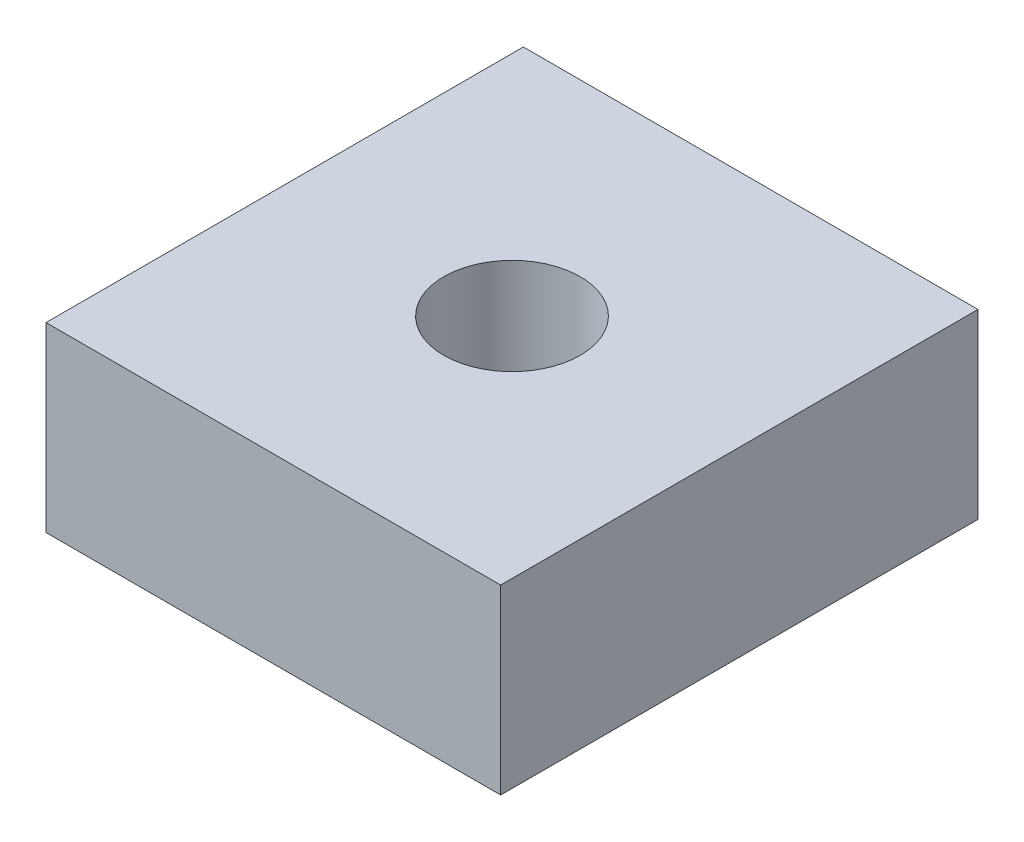
ISO-10303-21;
HEADER;
FILE_DESCRIPTION(('STEP AP214'),'2;1');
FILE_NAME('part.step','',(''),(''),'','','');
FILE_SCHEMA(('AUTOMOTIVE_DESIGN { 1 0 10303 214 1 1 1 1 }'));
ENDSEC;
DATA;
#1=APPLICATION_CONTEXT('core data for automotive mechanical design processes');
#2=APPLICATION_PROTOCOL_DEFINITION('international standard','automotive_design',2000,#1);
#3=PRODUCT_CONTEXT('',#1,'mechanical');
#4=PRODUCT('Part','Part','',(#3));
#5=PRODUCT_RELATED_PRODUCT_CATEGORY('part','',(#4));
#6=PRODUCT_DEFINITION_FORMATION('','',#4);
#7=PRODUCT_DEFINITION_CONTEXT('part definition',#1,'design');
#8=PRODUCT_DEFINITION('design','',#6,#7);
#9=PRODUCT_DEFINITION_SHAPE('','',#8);
#10=(LENGTH_UNIT() NAMED_UNIT(*) SI_UNIT(.MILLI.,.METRE.));
#11=(NAMED_UNIT(*) PLANE_ANGLE_UNIT() SI_UNIT($,.RADIAN.));
#12=(NAMED_UNIT(*) SI_UNIT($,.STERADIAN.) SOLID_ANGLE_UNIT());
#13=UNCERTAINTY_MEASURE_WITH_UNIT(LENGTH_MEASURE(1.E-05),#10,'distance_accuracy_value','');
#14=(GEOMETRIC_REPRESENTATION_CONTEXT(3) GLOBAL_UNCERTAINTY_ASSIGNED_CONTEXT((#13)) GLOBAL_UNIT_ASSIGNED_CONTEXT((#10,
#11,#12)) REPRESENTATION_CONTEXT('',''));
#15=CARTESIAN_POINT('',(0.,0.,0.));
#16=DIRECTION('',(0.,0.,1.));
#17=DIRECTION('',(1.,0.,0.));
#18=AXIS2_PLACEMENT_3D('',#15,#16,#17);
#19=CARTESIAN_POINT('',(0.,4.,0.));
#20=DIRECTION('',(1.,0.,0.));
#21=DIRECTION('',(0.,0.,-1.));
#22=AXIS2_PLACEMENT_3D('',#19,#20,#21);
#23=PLANE('',#22);
#24=DIRECTION('',(0.,0.,1.));
#25=VECTOR('',#24,1.);
#26=CARTESIAN_POINT('',(0.,0.,0.));
#27=LINE('',#26,#25);
#28=CARTESIAN_POINT('',(0.,0.,-10.5));
#29=VERTEX_POINT('',#28);
#30=CARTESIAN_POINT('',(0.,0.,0.));
#31=VERTEX_POINT('',#30);
#32=EDGE_CURVE('E107',#29,#31,#27,.T.);
#33=ORIENTED_EDGE('',*,*,#32,.T.);
#34=DIRECTION('',(0.,-1.,0.));
#35=VECTOR('',#34,1.);
#36=CARTESIAN_POINT('',(0.,4.,0.));
#37=LINE('',#36,#35);
#38=CARTESIAN_POINT('',(0.,4.,0.));
#39=VERTEX_POINT('',#38);
#40=EDGE_CURVE('E11',#39,#31,#37,.T.);
#41=ORIENTED_EDGE('',*,*,#40,.F.);
#42=DIRECTION('',(0.,0.,1.));
#43=VECTOR('',#42,1.);
#44=CARTESIAN_POINT('',(0.,4.,0.));
#45=LINE('',#44,#43);
#46=CARTESIAN_POINT('',(0.,4.,-10.5));
#47=VERTEX_POINT('',#46);
#48=EDGE_CURVE('E91',#47,#39,#45,.T.);
#49=ORIENTED_EDGE('',*,*,#48,.F.);
#50=DIRECTION('',(0.,-1.,0.));
#51=VECTOR('',#50,1.);
#52=CARTESIAN_POINT('',(0.,4.,-10.5));
#53=LINE('',#52,#51);
#54=EDGE_CURVE('E103',#47,#29,#53,.T.);
#55=ORIENTED_EDGE('',*,*,#54,.T.);
#56=EDGE_LOOP('',(#33,#41,#49,#55));
#57=FACE_BOUND('',#56,.T.);
#58=ADVANCED_FACE('F39',(#57),#23,.F.);
#59=CARTESIAN_POINT('',(0.,4.,0.));
#60=DIRECTION('',(0.,0.,-1.));
#61=DIRECTION('',(-1.,0.,0.));
#62=AXIS2_PLACEMENT_3D('',#59,#60,#61);
#63=PLANE('',#62);
#64=DIRECTION('',(1.,0.,0.));
#65=VECTOR('',#64,1.);
#66=CARTESIAN_POINT('',(0.,0.,0.));
#67=LINE('',#66,#65);
#68=CARTESIAN_POINT('',(10.,0.,0.));
#69=VERTEX_POINT('',#68);
#70=EDGE_CURVE('E96',#31,#69,#67,.T.);
#71=ORIENTED_EDGE('',*,*,#70,.T.);
#72=DIRECTION('',(0.,-1.,0.));
#73=VECTOR('',#72,1.);
#74=CARTESIAN_POINT('',(10.,4.,0.));
#75=LINE('',#74,#73);
#76=CARTESIAN_POINT('',(10.,4.,0.));
#77=VERTEX_POINT('',#76);
#78=EDGE_CURVE('E48',#77,#69,#75,.T.);
#79=ORIENTED_EDGE('',*,*,#78,.F.);
#80=DIRECTION('',(1.,0.,0.));
#81=VECTOR('',#80,1.);
#82=CARTESIAN_POINT('',(0.,4.,0.));
#83=LINE('',#82,#81);
#84=EDGE_CURVE('E86',#39,#77,#83,.T.);
#85=ORIENTED_EDGE('',*,*,#84,.F.);
#86=ORIENTED_EDGE('',*,*,#40,.T.);
#87=EDGE_LOOP('',(#71,#79,#85,#86));
#88=FACE_BOUND('',#87,.T.);
#89=ADVANCED_FACE('F95',(#88),#63,.F.);
#90=CARTESIAN_POINT('',(10.,4.,0.));
#91=DIRECTION('',(-1.,0.,0.));
#92=DIRECTION('',(0.,0.,1.));
#93=AXIS2_PLACEMENT_3D('',#90,#91,#92);
#94=PLANE('',#93);
#95=DIRECTION('',(0.,0.,-1.));
#96=VECTOR('',#95,1.);
#97=CARTESIAN_POINT('',(10.,0.,0.));
#98=LINE('',#97,#96);
#99=CARTESIAN_POINT('',(10.,0.,-10.5));
#100=VERTEX_POINT('',#99);
#101=EDGE_CURVE('E73',#69,#100,#98,.T.);
#102=ORIENTED_EDGE('',*,*,#101,.T.);
#103=DIRECTION('',(0.,-1.,0.));
#104=VECTOR('',#103,1.);
#105=CARTESIAN_POINT('',(10.,4.,-10.5));
#106=LINE('',#105,#104);
#107=CARTESIAN_POINT('',(10.,4.,-10.5));
#108=VERTEX_POINT('',#107);
#109=EDGE_CURVE('E98',#108,#100,#106,.T.);
#110=ORIENTED_EDGE('',*,*,#109,.F.);
#111=DIRECTION('',(0.,0.,-1.));
#112=VECTOR('',#111,1.);
#113=CARTESIAN_POINT('',(10.,4.,0.));
#114=LINE('',#113,#112);
#115=EDGE_CURVE('E89',#77,#108,#114,.T.);
#116=ORIENTED_EDGE('',*,*,#115,.F.);
#117=ORIENTED_EDGE('',*,*,#78,.T.);
#118=EDGE_LOOP('',(#102,#110,#116,#117));
#119=FACE_BOUND('',#118,.T.);
#120=ADVANCED_FACE('F99',(#119),#94,.F.);
#121=CARTESIAN_POINT('',(0.,4.,-10.5));
#122=DIRECTION('',(0.,0.,1.));
#123=DIRECTION('',(1.,0.,0.));
#124=AXIS2_PLACEMENT_3D('',#121,#122,#123);
#125=PLANE('',#124);
#126=DIRECTION('',(-1.,0.,0.));
#127=VECTOR('',#126,1.);
#128=CARTESIAN_POINT('',(0.,0.,-10.5));
#129=LINE('',#128,#127);
#130=EDGE_CURVE('E79',#100,#29,#129,.T.);
#131=ORIENTED_EDGE('',*,*,#130,.T.);
#132=ORIENTED_EDGE('',*,*,#54,.F.);
#133=DIRECTION('',(-1.,0.,0.));
#134=VECTOR('',#133,1.);
#135=CARTESIAN_POINT('',(0.,4.,-10.5));
#136=LINE('',#135,#134);
#137=EDGE_CURVE('E56',#108,#47,#136,.T.);
#138=ORIENTED_EDGE('',*,*,#137,.F.);
#139=ORIENTED_EDGE('',*,*,#109,.T.);
#140=EDGE_LOOP('',(#131,#132,#138,#139));
#141=FACE_BOUND('',#140,.T.);
#142=ADVANCED_FACE('F121',(#141),#125,.F.);
#143=CARTESIAN_POINT('',(0.,4.,0.));
#144=DIRECTION('',(0.,-1.,0.));
#145=DIRECTION('',(0.,0.,-1.));
#146=AXIS2_PLACEMENT_3D('',#143,#144,#145);
#147=PLANE('',#146);
#148=CARTESIAN_POINT('',(5.,4.,-5.25));
#149=DIRECTION('',(0.,1.,0.));
#150=DIRECTION('',(0.,0.,1.));
#151=AXIS2_PLACEMENT_3D('',#148,#149,#150);
#152=CIRCLE('',#151,1.5);
#153=CARTESIAN_POINT('',(5.,4.,-3.75));
#154=VERTEX_POINT('',#153);
#155=EDGE_CURVE('E128',#154,#154,#152,.T.);
#156=ORIENTED_EDGE('',*,*,#155,.F.);
#157=EDGE_LOOP('',(#156));
#158=FACE_BOUND('',#157,.T.);
#159=ORIENTED_EDGE('',*,*,#48,.T.);
#160=ORIENTED_EDGE('',*,*,#84,.T.);
#161=ORIENTED_EDGE('',*,*,#115,.T.);
#162=ORIENTED_EDGE('',*,*,#137,.T.);
#163=EDGE_LOOP('',(#159,#160,#161,#162));
#164=FACE_BOUND('',#163,.T.);
#165=ADVANCED_FACE('F87',(#158,#164),#147,.F.);
#166=CARTESIAN_POINT('',(0.,0.,0.));
#167=DIRECTION('',(0.,-1.,0.));
#168=DIRECTION('',(0.,0.,-1.));
#169=AXIS2_PLACEMENT_3D('',#166,#167,#168);
#170=PLANE('',#169);
#171=CARTESIAN_POINT('',(5.,0.,-5.25));
#172=DIRECTION('',(0.,1.,0.));
#173=DIRECTION('',(0.,0.,1.));
#174=AXIS2_PLACEMENT_3D('',#171,#172,#173);
#175=CIRCLE('',#174,1.5);
#176=CARTESIAN_POINT('',(5.,0.,-3.75));
#177=VERTEX_POINT('',#176);
#178=EDGE_CURVE('E111',#177,#177,#175,.T.);
#179=ORIENTED_EDGE('',*,*,#178,.T.);
#180=EDGE_LOOP('',(#179));
#181=FACE_BOUND('',#180,.T.);
#182=ORIENTED_EDGE('',*,*,#32,.F.);
#183=ORIENTED_EDGE('',*,*,#130,.F.);
#184=ORIENTED_EDGE('',*,*,#101,.F.);
#185=ORIENTED_EDGE('',*,*,#70,.F.);
#186=EDGE_LOOP('',(#182,#183,#184,#185));
#187=FACE_BOUND('',#186,.T.);
#188=ADVANCED_FACE('F124',(#181,#187),#170,.T.);
#189=CARTESIAN_POINT('',(5.,0.,-5.25));
#190=DIRECTION('',(0.,1.,0.));
#191=DIRECTION('',(0.,0.,1.));
#192=AXIS2_PLACEMENT_3D('',#189,#190,#191);
#193=CYLINDRICAL_SURFACE('',#192,1.5);
#194=ORIENTED_EDGE('',*,*,#178,.F.);
#195=EDGE_LOOP('',(#194));
#196=FACE_BOUND('',#195,.T.);
#197=ORIENTED_EDGE('',*,*,#155,.T.);
#198=EDGE_LOOP('',(#197));
#199=FACE_BOUND('',#198,.T.);
#200=ADVANCED_FACE('F137',(#196,#199),#193,.F.);
#201=CLOSED_SHELL('',(#58,#89,#120,#142,#165,#188,#200));
#202=MANIFOLD_SOLID_BREP('B2',#201);
#203=ADVANCED_BREP_SHAPE_REPRESENTATION('',(#18,#202),#14);
#204=SHAPE_DEFINITION_REPRESENTATION(#9,#203);
ENDSEC;
END-ISO-10303-21;
